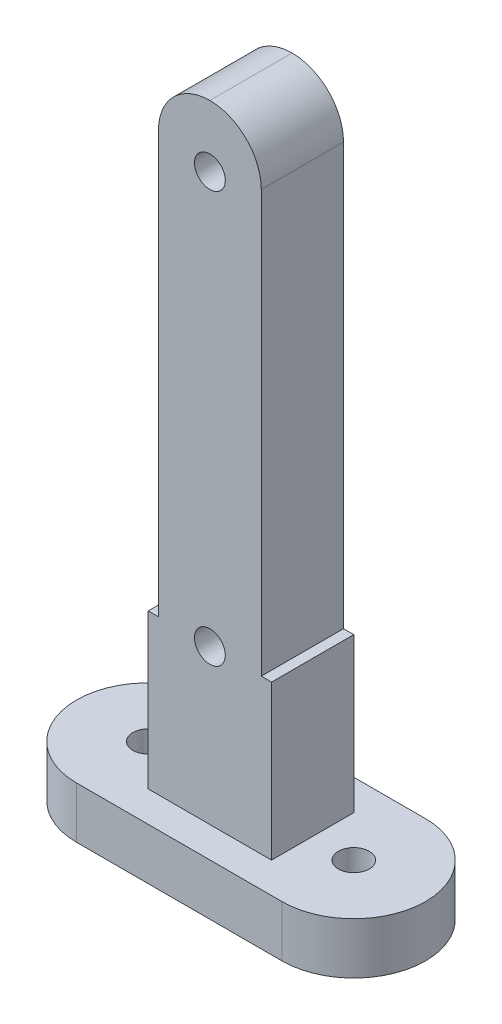
ISO-10303-21;
HEADER;
FILE_DESCRIPTION(('STEP AP214'),'2;1');
FILE_NAME('part.step','',(''),(''),'','','');
FILE_SCHEMA(('AUTOMOTIVE_DESIGN { 1 0 10303 214 1 1 1 1 }'));
ENDSEC;
DATA;
#1=APPLICATION_CONTEXT('core data for automotive mechanical design processes');
#2=APPLICATION_PROTOCOL_DEFINITION('international standard','automotive_design',2000,#1);
#3=PRODUCT_CONTEXT('',#1,'mechanical');
#4=PRODUCT('Part','Part','',(#3));
#5=PRODUCT_RELATED_PRODUCT_CATEGORY('part','',(#4));
#6=PRODUCT_DEFINITION_FORMATION('','',#4);
#7=PRODUCT_DEFINITION_CONTEXT('part definition',#1,'design');
#8=PRODUCT_DEFINITION('design','',#6,#7);
#9=PRODUCT_DEFINITION_SHAPE('','',#8);
#10=(LENGTH_UNIT() NAMED_UNIT(*) SI_UNIT(.MILLI.,.METRE.));
#11=(NAMED_UNIT(*) PLANE_ANGLE_UNIT() SI_UNIT($,.RADIAN.));
#12=(NAMED_UNIT(*) SI_UNIT($,.STERADIAN.) SOLID_ANGLE_UNIT());
#13=UNCERTAINTY_MEASURE_WITH_UNIT(LENGTH_MEASURE(1.E-05),#10,'distance_accuracy_value','');
#14=(GEOMETRIC_REPRESENTATION_CONTEXT(3) GLOBAL_UNCERTAINTY_ASSIGNED_CONTEXT((#13)) GLOBAL_UNIT_ASSIGNED_CONTEXT((#10,
#11,#12)) REPRESENTATION_CONTEXT('',''));
#15=CARTESIAN_POINT('',(0.,0.,0.));
#16=DIRECTION('',(0.,0.,1.));
#17=DIRECTION('',(1.,0.,0.));
#18=AXIS2_PLACEMENT_3D('',#15,#16,#17);
#19=CARTESIAN_POINT('',(0.,20.,0.));
#20=DIRECTION('',(0.,1.,0.));
#21=DIRECTION('',(0.,0.,1.));
#22=AXIS2_PLACEMENT_3D('',#19,#20,#21);
#23=PLANE('',#22);
#24=DIRECTION('',(1.,0.,0.));
#25=VECTOR('',#24,1.);
#26=CARTESIAN_POINT('',(-6.,20.,4.));
#27=LINE('',#26,#25);
#28=CARTESIAN_POINT('',(-6.,20.,4.));
#29=VERTEX_POINT('',#28);
#30=CARTESIAN_POINT('',(-5.,20.,4.));
#31=VERTEX_POINT('',#30);
#32=EDGE_CURVE('E216',#29,#31,#27,.T.);
#33=ORIENTED_EDGE('',*,*,#32,.T.);
#34=DIRECTION('',(0.,0.,-1.));
#35=VECTOR('',#34,1.);
#36=CARTESIAN_POINT('',(-5.,20.,0.));
#37=LINE('',#36,#35);
#38=CARTESIAN_POINT('',(-5.,20.,-4.));
#39=VERTEX_POINT('',#38);
#40=EDGE_CURVE('E197',#31,#39,#37,.T.);
#41=ORIENTED_EDGE('',*,*,#40,.T.);
#42=DIRECTION('',(1.,0.,0.));
#43=VECTOR('',#42,1.);
#44=CARTESIAN_POINT('',(-6.,20.,-4.));
#45=LINE('',#44,#43);
#46=CARTESIAN_POINT('',(-6.,20.,-4.));
#47=VERTEX_POINT('',#46);
#48=EDGE_CURVE('E339',#47,#39,#45,.T.);
#49=ORIENTED_EDGE('',*,*,#48,.F.);
#50=DIRECTION('',(0.,0.,-1.));
#51=VECTOR('',#50,1.);
#52=CARTESIAN_POINT('',(-6.,20.,4.));
#53=LINE('',#52,#51);
#54=EDGE_CURVE('E225',#29,#47,#53,.T.);
#55=ORIENTED_EDGE('',*,*,#54,.F.);
#56=EDGE_LOOP('',(#33,#41,#49,#55));
#57=FACE_BOUND('',#56,.T.);
#58=ADVANCED_FACE('F103',(#57),#23,.T.);
#59=CARTESIAN_POINT('',(-10.,5.,0.));
#60=DIRECTION('',(0.,1.,0.));
#61=DIRECTION('',(0.,0.,1.));
#62=AXIS2_PLACEMENT_3D('',#59,#60,#61);
#63=PLANE('',#62);
#64=DIRECTION('',(1.,0.,0.));
#65=VECTOR('',#64,1.);
#66=CARTESIAN_POINT('',(-6.,5.,-4.));
#67=LINE('',#66,#65);
#68=CARTESIAN_POINT('',(-6.,5.,-4.));
#69=VERTEX_POINT('',#68);
#70=CARTESIAN_POINT('',(6.,5.,-4.));
#71=VERTEX_POINT('',#70);
#72=EDGE_CURVE('E237',#69,#71,#67,.T.);
#73=ORIENTED_EDGE('',*,*,#72,.T.);
#74=DIRECTION('',(0.,0.,-1.));
#75=VECTOR('',#74,1.);
#76=CARTESIAN_POINT('',(6.,5.,4.));
#77=LINE('',#76,#75);
#78=CARTESIAN_POINT('',(6.,5.,4.));
#79=VERTEX_POINT('',#78);
#80=EDGE_CURVE('E241',#79,#71,#77,.T.);
#81=ORIENTED_EDGE('',*,*,#80,.F.);
#82=DIRECTION('',(1.,0.,0.));
#83=VECTOR('',#82,1.);
#84=CARTESIAN_POINT('',(-6.,5.,4.));
#85=LINE('',#84,#83);
#86=CARTESIAN_POINT('',(-6.,5.,4.));
#87=VERTEX_POINT('',#86);
#88=EDGE_CURVE('E245',#87,#79,#85,.T.);
#89=ORIENTED_EDGE('',*,*,#88,.F.);
#90=DIRECTION('',(0.,0.,-1.));
#91=VECTOR('',#90,1.);
#92=CARTESIAN_POINT('',(-6.,5.,4.));
#93=LINE('',#92,#91);
#94=EDGE_CURVE('E249',#87,#69,#93,.T.);
#95=ORIENTED_EDGE('',*,*,#94,.T.);
#96=EDGE_LOOP('',(#73,#81,#89,#95));
#97=FACE_BOUND('',#96,.T.);
#98=CARTESIAN_POINT('',(-10.,5.,0.));
#99=DIRECTION('',(0.,1.,0.));
#100=DIRECTION('',(0.,0.,1.));
#101=AXIS2_PLACEMENT_3D('',#98,#99,#100);
#102=CIRCLE('',#101,1.5);
#103=CARTESIAN_POINT('',(-10.,5.,1.5));
#104=VERTEX_POINT('',#103);
#105=EDGE_CURVE('E274',#104,#104,#102,.T.);
#106=ORIENTED_EDGE('',*,*,#105,.F.);
#107=EDGE_LOOP('',(#106));
#108=FACE_BOUND('',#107,.T.);
#109=CARTESIAN_POINT('',(-10.,5.,0.));
#110=DIRECTION('',(0.,1.,0.));
#111=DIRECTION('',(0.,0.,1.));
#112=AXIS2_PLACEMENT_3D('',#109,#110,#111);
#113=CIRCLE('',#112,6.98288273286698);
#114=CARTESIAN_POINT('',(-10.,5.,-6.98288273286698));
#115=VERTEX_POINT('',#114);
#116=CARTESIAN_POINT('',(-10.,5.,6.98288273286698));
#117=VERTEX_POINT('',#116);
#118=EDGE_CURVE('E282',#115,#117,#113,.T.);
#119=ORIENTED_EDGE('',*,*,#118,.T.);
#120=DIRECTION('',(1.,0.,0.));
#121=VECTOR('',#120,1.);
#122=CARTESIAN_POINT('',(-10.,5.,6.98288273286698));
#123=LINE('',#122,#121);
#124=CARTESIAN_POINT('',(10.,5.,6.98288273286698));
#125=VERTEX_POINT('',#124);
#126=EDGE_CURVE('E286',#117,#125,#123,.T.);
#127=ORIENTED_EDGE('',*,*,#126,.T.);
#128=CARTESIAN_POINT('',(10.,5.,0.));
#129=DIRECTION('',(0.,1.,0.));
#130=DIRECTION('',(0.,0.,1.));
#131=AXIS2_PLACEMENT_3D('',#128,#129,#130);
#132=CIRCLE('',#131,6.98288273286698);
#133=CARTESIAN_POINT('',(10.,5.,-6.98288273286698));
#134=VERTEX_POINT('',#133);
#135=EDGE_CURVE('E290',#125,#134,#132,.T.);
#136=ORIENTED_EDGE('',*,*,#135,.T.);
#137=DIRECTION('',(1.,0.,0.));
#138=VECTOR('',#137,1.);
#139=CARTESIAN_POINT('',(-10.,5.,-6.98288273286698));
#140=LINE('',#139,#138);
#141=EDGE_CURVE('E293',#115,#134,#140,.T.);
#142=ORIENTED_EDGE('',*,*,#141,.F.);
#143=EDGE_LOOP('',(#119,#127,#136,#142));
#144=FACE_BOUND('',#143,.T.);
#145=CARTESIAN_POINT('',(10.,5.,0.));
#146=DIRECTION('',(0.,1.,0.));
#147=DIRECTION('',(0.,0.,1.));
#148=AXIS2_PLACEMENT_3D('',#145,#146,#147);
#149=CIRCLE('',#148,1.5);
#150=CARTESIAN_POINT('',(10.,5.,1.5));
#151=VERTEX_POINT('',#150);
#152=EDGE_CURVE('E266',#151,#151,#149,.T.);
#153=ORIENTED_EDGE('',*,*,#152,.F.);
#154=EDGE_LOOP('',(#153));
#155=FACE_BOUND('',#154,.T.);
#156=ADVANCED_FACE('F367',(#97,#108,#144,#155),#63,.T.);
#157=CARTESIAN_POINT('',(-10.,0.,0.));
#158=DIRECTION('',(0.,1.,0.));
#159=DIRECTION('',(0.,0.,1.));
#160=AXIS2_PLACEMENT_3D('',#157,#158,#159);
#161=PLANE('',#160);
#162=CARTESIAN_POINT('',(-10.,0.,0.));
#163=DIRECTION('',(0.,1.,0.));
#164=DIRECTION('',(0.,0.,1.));
#165=AXIS2_PLACEMENT_3D('',#162,#163,#164);
#166=CIRCLE('',#165,6.98288273286698);
#167=CARTESIAN_POINT('',(-10.,0.,-6.98288273286698));
#168=VERTEX_POINT('',#167);
#169=CARTESIAN_POINT('',(-10.,0.,6.98288273286698));
#170=VERTEX_POINT('',#169);
#171=EDGE_CURVE('E278',#168,#170,#166,.T.);
#172=ORIENTED_EDGE('',*,*,#171,.F.);
#173=DIRECTION('',(1.,0.,0.));
#174=VECTOR('',#173,1.);
#175=CARTESIAN_POINT('',(-10.,0.,-6.98288273286698));
#176=LINE('',#175,#174);
#177=CARTESIAN_POINT('',(10.,0.,-6.98288273286698));
#178=VERTEX_POINT('',#177);
#179=EDGE_CURVE('E287',#168,#178,#176,.T.);
#180=ORIENTED_EDGE('',*,*,#179,.T.);
#181=CARTESIAN_POINT('',(10.,0.,0.));
#182=DIRECTION('',(0.,1.,0.));
#183=DIRECTION('',(0.,0.,1.));
#184=AXIS2_PLACEMENT_3D('',#181,#182,#183);
#185=CIRCLE('',#184,6.98288273286698);
#186=CARTESIAN_POINT('',(10.,0.,6.98288273286698));
#187=VERTEX_POINT('',#186);
#188=EDGE_CURVE('E304',#187,#178,#185,.T.);
#189=ORIENTED_EDGE('',*,*,#188,.F.);
#190=DIRECTION('',(1.,0.,0.));
#191=VECTOR('',#190,1.);
#192=CARTESIAN_POINT('',(-10.,0.,6.98288273286698));
#193=LINE('',#192,#191);
#194=EDGE_CURVE('E301',#170,#187,#193,.T.);
#195=ORIENTED_EDGE('',*,*,#194,.F.);
#196=EDGE_LOOP('',(#172,#180,#189,#195));
#197=FACE_BOUND('',#196,.T.);
#198=CARTESIAN_POINT('',(-10.,0.,0.));
#199=DIRECTION('',(0.,1.,0.));
#200=DIRECTION('',(0.,0.,1.));
#201=AXIS2_PLACEMENT_3D('',#198,#199,#200);
#202=CIRCLE('',#201,1.5);
#203=CARTESIAN_POINT('',(-10.,0.,1.5));
#204=VERTEX_POINT('',#203);
#205=EDGE_CURVE('E270',#204,#204,#202,.T.);
#206=ORIENTED_EDGE('',*,*,#205,.T.);
#207=EDGE_LOOP('',(#206));
#208=FACE_BOUND('',#207,.T.);
#209=CARTESIAN_POINT('',(10.,0.,0.));
#210=DIRECTION('',(0.,1.,0.));
#211=DIRECTION('',(0.,0.,1.));
#212=AXIS2_PLACEMENT_3D('',#209,#210,#211);
#213=CIRCLE('',#212,1.5);
#214=CARTESIAN_POINT('',(10.,0.,1.5));
#215=VERTEX_POINT('',#214);
#216=EDGE_CURVE('E257',#215,#215,#213,.T.);
#217=ORIENTED_EDGE('',*,*,#216,.T.);
#218=EDGE_LOOP('',(#217));
#219=FACE_BOUND('',#218,.T.);
#220=ADVANCED_FACE('F393',(#197,#208,#219),#161,.F.);
#221=CARTESIAN_POINT('',(-10.,5.,0.));
#222=DIRECTION('',(0.,-1.,0.));
#223=DIRECTION('',(0.,0.,-1.));
#224=AXIS2_PLACEMENT_3D('',#221,#222,#223);
#225=CYLINDRICAL_SURFACE('',#224,6.98288273286698);
#226=ORIENTED_EDGE('',*,*,#171,.T.);
#227=DIRECTION('',(0.,-1.,0.));
#228=VECTOR('',#227,1.);
#229=CARTESIAN_POINT('',(-10.,5.,6.98288273286698));
#230=LINE('',#229,#228);
#231=EDGE_CURVE('E210',#117,#170,#230,.T.);
#232=ORIENTED_EDGE('',*,*,#231,.F.);
#233=ORIENTED_EDGE('',*,*,#118,.F.);
#234=DIRECTION('',(0.,-1.,0.));
#235=VECTOR('',#234,1.);
#236=CARTESIAN_POINT('',(-10.,5.,-6.98288273286698));
#237=LINE('',#236,#235);
#238=EDGE_CURVE('E297',#115,#168,#237,.T.);
#239=ORIENTED_EDGE('',*,*,#238,.T.);
#240=EDGE_LOOP('',(#226,#232,#233,#239));
#241=FACE_BOUND('',#240,.T.);
#242=ADVANCED_FACE('F424',(#241),#225,.T.);
#243=CARTESIAN_POINT('',(-10.,5.,6.98288273286698));
#244=DIRECTION('',(0.,0.,-1.));
#245=DIRECTION('',(-1.,0.,0.));
#246=AXIS2_PLACEMENT_3D('',#243,#244,#245);
#247=PLANE('',#246);
#248=ORIENTED_EDGE('',*,*,#194,.T.);
#249=DIRECTION('',(0.,-1.,0.));
#250=VECTOR('',#249,1.);
#251=CARTESIAN_POINT('',(10.,5.,6.98288273286698));
#252=LINE('',#251,#250);
#253=EDGE_CURVE('E316',#125,#187,#252,.T.);
#254=ORIENTED_EDGE('',*,*,#253,.F.);
#255=ORIENTED_EDGE('',*,*,#126,.F.);
#256=ORIENTED_EDGE('',*,*,#231,.T.);
#257=EDGE_LOOP('',(#248,#254,#255,#256));
#258=FACE_BOUND('',#257,.T.);
#259=ADVANCED_FACE('F432',(#258),#247,.F.);
#260=CARTESIAN_POINT('',(10.,5.,0.));
#261=DIRECTION('',(0.,-1.,0.));
#262=DIRECTION('',(0.,0.,-1.));
#263=AXIS2_PLACEMENT_3D('',#260,#261,#262);
#264=CYLINDRICAL_SURFACE('',#263,6.98288273286698);
#265=ORIENTED_EDGE('',*,*,#188,.T.);
#266=DIRECTION('',(0.,-1.,0.));
#267=VECTOR('',#266,1.);
#268=CARTESIAN_POINT('',(10.,5.,-6.98288273286698));
#269=LINE('',#268,#267);
#270=EDGE_CURVE('E313',#134,#178,#269,.T.);
#271=ORIENTED_EDGE('',*,*,#270,.F.);
#272=ORIENTED_EDGE('',*,*,#135,.F.);
#273=ORIENTED_EDGE('',*,*,#253,.T.);
#274=EDGE_LOOP('',(#265,#271,#272,#273));
#275=FACE_BOUND('',#274,.T.);
#276=ADVANCED_FACE('F428',(#275),#264,.T.);
#277=CARTESIAN_POINT('',(-10.,5.,-6.98288273286698));
#278=DIRECTION('',(0.,0.,-1.));
#279=DIRECTION('',(-1.,0.,0.));
#280=AXIS2_PLACEMENT_3D('',#277,#278,#279);
#281=PLANE('',#280);
#282=ORIENTED_EDGE('',*,*,#179,.F.);
#283=ORIENTED_EDGE('',*,*,#238,.F.);
#284=ORIENTED_EDGE('',*,*,#141,.T.);
#285=ORIENTED_EDGE('',*,*,#270,.T.);
#286=EDGE_LOOP('',(#282,#283,#284,#285));
#287=FACE_BOUND('',#286,.T.);
#288=ADVANCED_FACE('F419',(#287),#281,.T.);
#289=CARTESIAN_POINT('',(-10.,5.,0.));
#290=DIRECTION('',(0.,-1.,0.));
#291=DIRECTION('',(0.,0.,-1.));
#292=AXIS2_PLACEMENT_3D('',#289,#290,#291);
#293=CYLINDRICAL_SURFACE('',#292,1.5);
#294=ORIENTED_EDGE('',*,*,#105,.T.);
#295=EDGE_LOOP('',(#294));
#296=FACE_BOUND('',#295,.T.);
#297=ORIENTED_EDGE('',*,*,#205,.F.);
#298=EDGE_LOOP('',(#297));
#299=FACE_BOUND('',#298,.T.);
#300=ADVANCED_FACE('F416',(#296,#299),#293,.F.);
#301=CARTESIAN_POINT('',(10.,5.,0.));
#302=DIRECTION('',(0.,-1.,0.));
#303=DIRECTION('',(0.,0.,-1.));
#304=AXIS2_PLACEMENT_3D('',#301,#302,#303);
#305=CYLINDRICAL_SURFACE('',#304,1.5);
#306=ORIENTED_EDGE('',*,*,#152,.T.);
#307=EDGE_LOOP('',(#306));
#308=FACE_BOUND('',#307,.T.);
#309=ORIENTED_EDGE('',*,*,#216,.F.);
#310=EDGE_LOOP('',(#309));
#311=FACE_BOUND('',#310,.T.);
#312=ADVANCED_FACE('F412',(#308,#311),#305,.F.);
#313=CARTESIAN_POINT('',(-6.,20.,-4.));
#314=DIRECTION('',(0.,0.,-1.));
#315=DIRECTION('',(-1.,0.,0.));
#316=AXIS2_PLACEMENT_3D('',#313,#314,#315);
#317=PLANE('',#316);
#318=CARTESIAN_POINT('',(0.,20.,-4.));
#319=DIRECTION('',(0.,0.,1.));
#320=DIRECTION('',(1.,0.,0.));
#321=AXIS2_PLACEMENT_3D('',#318,#319,#320);
#322=CIRCLE('',#321,1.5);
#323=CARTESIAN_POINT('',(1.5,20.,-4.));
#324=VERTEX_POINT('',#323);
#325=EDGE_CURVE('E348',#324,#324,#322,.T.);
#326=ORIENTED_EDGE('',*,*,#325,.T.);
#327=EDGE_LOOP('',(#326));
#328=FACE_BOUND('',#327,.T.);
#329=DIRECTION('',(0.,1.,0.));
#330=VECTOR('',#329,1.);
#331=CARTESIAN_POINT('',(-5.,15.6245028579639,-4.));
#332=LINE('',#331,#330);
#333=CARTESIAN_POINT('',(-5.,61.,-4.));
#334=VERTEX_POINT('',#333);
#335=EDGE_CURVE('E203',#39,#334,#332,.T.);
#336=ORIENTED_EDGE('',*,*,#335,.T.);
#337=CARTESIAN_POINT('',(0.,61.,-4.));
#338=DIRECTION('',(0.,0.,-1.));
#339=DIRECTION('',(-1.,0.,0.));
#340=AXIS2_PLACEMENT_3D('',#337,#338,#339);
#341=CIRCLE('',#340,5.);
#342=CARTESIAN_POINT('',(0.,66.,-4.));
#343=VERTEX_POINT('',#342);
#344=EDGE_CURVE('E113',#334,#343,#341,.T.);
#345=ORIENTED_EDGE('',*,*,#344,.T.);
#346=CARTESIAN_POINT('',(0.,61.,-4.));
#347=DIRECTION('',(0.,0.,-1.));
#348=DIRECTION('',(-1.,0.,0.));
#349=AXIS2_PLACEMENT_3D('',#346,#347,#348);
#350=CIRCLE('',#349,5.);
#351=CARTESIAN_POINT('',(5.,61.,-4.));
#352=VERTEX_POINT('',#351);
#353=EDGE_CURVE('E123',#343,#352,#350,.T.);
#354=ORIENTED_EDGE('',*,*,#353,.T.);
#355=DIRECTION('',(0.,1.,0.));
#356=VECTOR('',#355,1.);
#357=CARTESIAN_POINT('',(5.,15.6245028579639,-4.));
#358=LINE('',#357,#356);
#359=CARTESIAN_POINT('',(5.,20.,-4.));
#360=VERTEX_POINT('',#359);
#361=EDGE_CURVE('E221',#360,#352,#358,.T.);
#362=ORIENTED_EDGE('',*,*,#361,.F.);
#363=CARTESIAN_POINT('',(6.,20.,-4.));
#364=VERTEX_POINT('',#363);
#365=EDGE_CURVE('E253',#360,#364,#45,.T.);
#366=ORIENTED_EDGE('',*,*,#365,.T.);
#367=DIRECTION('',(0.,-1.,0.));
#368=VECTOR('',#367,1.);
#369=CARTESIAN_POINT('',(6.,20.,-4.));
#370=LINE('',#369,#368);
#371=EDGE_CURVE('E231',#364,#71,#370,.T.);
#372=ORIENTED_EDGE('',*,*,#371,.T.);
#373=ORIENTED_EDGE('',*,*,#72,.F.);
#374=DIRECTION('',(0.,-1.,0.));
#375=VECTOR('',#374,1.);
#376=CARTESIAN_POINT('',(-6.,20.,-4.));
#377=LINE('',#376,#375);
#378=EDGE_CURVE('E254',#47,#69,#377,.T.);
#379=ORIENTED_EDGE('',*,*,#378,.F.);
#380=ORIENTED_EDGE('',*,*,#48,.T.);
#381=EDGE_LOOP('',(#336,#345,#354,#362,#366,#372,#373,#379,#380));
#382=FACE_BOUND('',#381,.T.);
#383=CARTESIAN_POINT('',(0.,60.,-4.));
#384=DIRECTION('',(0.,0.,1.));
#385=DIRECTION('',(1.,0.,0.));
#386=AXIS2_PLACEMENT_3D('',#383,#384,#385);
#387=CIRCLE('',#386,1.5);
#388=CARTESIAN_POINT('',(1.5,60.,-4.));
#389=VERTEX_POINT('',#388);
#390=EDGE_CURVE('E634',#389,#389,#387,.T.);
#391=ORIENTED_EDGE('',*,*,#390,.T.);
#392=EDGE_LOOP('',(#391));
#393=FACE_BOUND('',#392,.T.);
#394=ADVANCED_FACE('F337',(#328,#382,#393),#317,.T.);
#395=CARTESIAN_POINT('',(-6.,20.,4.));
#396=DIRECTION('',(-1.,0.,0.));
#397=DIRECTION('',(0.,0.,1.));
#398=AXIS2_PLACEMENT_3D('',#395,#396,#397);
#399=PLANE('',#398);
#400=ORIENTED_EDGE('',*,*,#94,.F.);
#401=DIRECTION('',(0.,-1.,0.));
#402=VECTOR('',#401,1.);
#403=CARTESIAN_POINT('',(-6.,20.,4.));
#404=LINE('',#403,#402);
#405=EDGE_CURVE('E258',#29,#87,#404,.T.);
#406=ORIENTED_EDGE('',*,*,#405,.F.);
#407=ORIENTED_EDGE('',*,*,#54,.T.);
#408=ORIENTED_EDGE('',*,*,#378,.T.);
#409=EDGE_LOOP('',(#400,#406,#407,#408));
#410=FACE_BOUND('',#409,.T.);
#411=ADVANCED_FACE('F371',(#410),#399,.T.);
#412=CARTESIAN_POINT('',(-6.,20.,4.));
#413=DIRECTION('',(0.,0.,-1.));
#414=DIRECTION('',(-1.,0.,0.));
#415=AXIS2_PLACEMENT_3D('',#412,#413,#414);
#416=PLANE('',#415);
#417=CARTESIAN_POINT('',(0.,61.,4.));
#418=DIRECTION('',(0.,0.,-1.));
#419=DIRECTION('',(-1.,0.,0.));
#420=AXIS2_PLACEMENT_3D('',#417,#418,#419);
#421=CIRCLE('',#420,5.);
#422=CARTESIAN_POINT('',(5.,61.,4.));
#423=VERTEX_POINT('',#422);
#424=CARTESIAN_POINT('',(0.,66.,4.));
#425=VERTEX_POINT('',#424);
#426=EDGE_CURVE('E325',#423,#425,#421,.F.);
#427=ORIENTED_EDGE('',*,*,#426,.T.);
#428=CARTESIAN_POINT('',(0.,61.,4.));
#429=DIRECTION('',(0.,0.,-1.));
#430=DIRECTION('',(-1.,0.,0.));
#431=AXIS2_PLACEMENT_3D('',#428,#429,#430);
#432=CIRCLE('',#431,5.);
#433=CARTESIAN_POINT('',(-5.,61.,4.));
#434=VERTEX_POINT('',#433);
#435=EDGE_CURVE('E219',#425,#434,#432,.F.);
#436=ORIENTED_EDGE('',*,*,#435,.T.);
#437=DIRECTION('',(0.,1.,0.));
#438=VECTOR('',#437,1.);
#439=CARTESIAN_POINT('',(-5.,15.6245028579639,4.));
#440=LINE('',#439,#438);
#441=EDGE_CURVE('E201',#31,#434,#440,.T.);
#442=ORIENTED_EDGE('',*,*,#441,.F.);
#443=ORIENTED_EDGE('',*,*,#32,.F.);
#444=ORIENTED_EDGE('',*,*,#405,.T.);
#445=ORIENTED_EDGE('',*,*,#88,.T.);
#446=DIRECTION('',(0.,-1.,0.));
#447=VECTOR('',#446,1.);
#448=CARTESIAN_POINT('',(6.,20.,4.));
#449=LINE('',#448,#447);
#450=CARTESIAN_POINT('',(6.,20.,4.));
#451=VERTEX_POINT('',#450);
#452=EDGE_CURVE('E261',#451,#79,#449,.T.);
#453=ORIENTED_EDGE('',*,*,#452,.F.);
#454=CARTESIAN_POINT('',(5.,20.,4.));
#455=VERTEX_POINT('',#454);
#456=EDGE_CURVE('E227',#455,#451,#27,.T.);
#457=ORIENTED_EDGE('',*,*,#456,.F.);
#458=DIRECTION('',(0.,1.,0.));
#459=VECTOR('',#458,1.);
#460=CARTESIAN_POINT('',(5.,15.6245028579639,4.));
#461=LINE('',#460,#459);
#462=EDGE_CURVE('E222',#455,#423,#461,.T.);
#463=ORIENTED_EDGE('',*,*,#462,.T.);
#464=EDGE_LOOP('',(#427,#436,#442,#443,#444,#445,#453,#457,#463));
#465=FACE_BOUND('',#464,.T.);
#466=CARTESIAN_POINT('',(0.,20.,4.));
#467=DIRECTION('',(0.,0.,1.));
#468=DIRECTION('',(1.,0.,0.));
#469=AXIS2_PLACEMENT_3D('',#466,#467,#468);
#470=CIRCLE('',#469,1.5);
#471=CARTESIAN_POINT('',(1.5,20.,4.));
#472=VERTEX_POINT('',#471);
#473=EDGE_CURVE('E641',#472,#472,#470,.T.);
#474=ORIENTED_EDGE('',*,*,#473,.F.);
#475=EDGE_LOOP('',(#474));
#476=FACE_BOUND('',#475,.T.);
#477=CARTESIAN_POINT('',(0.,60.,4.));
#478=DIRECTION('',(0.,0.,1.));
#479=DIRECTION('',(1.,0.,0.));
#480=AXIS2_PLACEMENT_3D('',#477,#478,#479);
#481=CIRCLE('',#480,1.5);
#482=CARTESIAN_POINT('',(1.5,60.,4.));
#483=VERTEX_POINT('',#482);
#484=EDGE_CURVE('E379',#483,#483,#481,.T.);
#485=ORIENTED_EDGE('',*,*,#484,.F.);
#486=EDGE_LOOP('',(#485));
#487=FACE_BOUND('',#486,.T.);
#488=ADVANCED_FACE('F214',(#465,#476,#487),#416,.F.);
#489=CARTESIAN_POINT('',(6.,20.,4.));
#490=DIRECTION('',(-1.,0.,0.));
#491=DIRECTION('',(0.,0.,1.));
#492=AXIS2_PLACEMENT_3D('',#489,#490,#491);
#493=PLANE('',#492);
#494=ORIENTED_EDGE('',*,*,#80,.T.);
#495=ORIENTED_EDGE('',*,*,#371,.F.);
#496=DIRECTION('',(0.,0.,-1.));
#497=VECTOR('',#496,1.);
#498=CARTESIAN_POINT('',(6.,20.,4.));
#499=LINE('',#498,#497);
#500=EDGE_CURVE('E233',#451,#364,#499,.T.);
#501=ORIENTED_EDGE('',*,*,#500,.F.);
#502=ORIENTED_EDGE('',*,*,#452,.T.);
#503=EDGE_LOOP('',(#494,#495,#501,#502));
#504=FACE_BOUND('',#503,.T.);
#505=ADVANCED_FACE('F363',(#504),#493,.F.);
#506=DIRECTION('',(0.,0.,-1.));
#507=VECTOR('',#506,1.);
#508=CARTESIAN_POINT('',(5.,20.,0.));
#509=LINE('',#508,#507);
#510=EDGE_CURVE('E209',#455,#360,#509,.T.);
#511=ORIENTED_EDGE('',*,*,#510,.F.);
#512=ORIENTED_EDGE('',*,*,#456,.T.);
#513=ORIENTED_EDGE('',*,*,#500,.T.);
#514=ORIENTED_EDGE('',*,*,#365,.F.);
#515=EDGE_LOOP('',(#511,#512,#513,#514));
#516=FACE_BOUND('',#515,.T.);
#517=ADVANCED_FACE('F359',(#516),#23,.T.);
#518=CARTESIAN_POINT('',(5.,15.6245028579639,-4.));
#519=DIRECTION('',(1.,0.,0.));
#520=DIRECTION('',(0.,0.,-1.));
#521=AXIS2_PLACEMENT_3D('',#518,#519,#520);
#522=PLANE('',#521);
#523=ORIENTED_EDGE('',*,*,#361,.T.);
#524=DIRECTION('',(0.,0.,1.));
#525=VECTOR('',#524,1.);
#526=CARTESIAN_POINT('',(5.,61.,4.));
#527=LINE('',#526,#525);
#528=EDGE_CURVE('E12',#352,#423,#527,.T.);
#529=ORIENTED_EDGE('',*,*,#528,.T.);
#530=ORIENTED_EDGE('',*,*,#462,.F.);
#531=ORIENTED_EDGE('',*,*,#510,.T.);
#532=EDGE_LOOP('',(#523,#529,#530,#531));
#533=FACE_BOUND('',#532,.T.);
#534=ADVANCED_FACE('F398',(#533),#522,.T.);
#535=CARTESIAN_POINT('',(-5.,15.6245028579639,-4.));
#536=DIRECTION('',(1.,0.,0.));
#537=DIRECTION('',(0.,0.,-1.));
#538=AXIS2_PLACEMENT_3D('',#535,#536,#537);
#539=PLANE('',#538);
#540=ORIENTED_EDGE('',*,*,#441,.T.);
#541=DIRECTION('',(0.,0.,1.));
#542=VECTOR('',#541,1.);
#543=CARTESIAN_POINT('',(-5.,61.,-4.));
#544=LINE('',#543,#542);
#545=EDGE_CURVE('E330',#434,#334,#544,.F.);
#546=ORIENTED_EDGE('',*,*,#545,.T.);
#547=ORIENTED_EDGE('',*,*,#335,.F.);
#548=ORIENTED_EDGE('',*,*,#40,.F.);
#549=EDGE_LOOP('',(#540,#546,#547,#548));
#550=FACE_BOUND('',#549,.T.);
#551=ADVANCED_FACE('F199',(#550),#539,.F.);
#552=CARTESIAN_POINT('',(0.,20.,-4.));
#553=DIRECTION('',(0.,0.,1.));
#554=DIRECTION('',(1.,0.,0.));
#555=AXIS2_PLACEMENT_3D('',#552,#553,#554);
#556=CYLINDRICAL_SURFACE('',#555,1.5);
#557=ORIENTED_EDGE('',*,*,#473,.T.);
#558=EDGE_LOOP('',(#557));
#559=FACE_BOUND('',#558,.T.);
#560=ORIENTED_EDGE('',*,*,#325,.F.);
#561=EDGE_LOOP('',(#560));
#562=FACE_BOUND('',#561,.T.);
#563=ADVANCED_FACE('F504',(#559,#562),#556,.F.);
#564=CARTESIAN_POINT('',(0.,60.,-4.));
#565=DIRECTION('',(0.,0.,1.));
#566=DIRECTION('',(1.,0.,0.));
#567=AXIS2_PLACEMENT_3D('',#564,#565,#566);
#568=CYLINDRICAL_SURFACE('',#567,1.5);
#569=ORIENTED_EDGE('',*,*,#390,.F.);
#570=EDGE_LOOP('',(#569));
#571=FACE_BOUND('',#570,.T.);
#572=ORIENTED_EDGE('',*,*,#484,.T.);
#573=EDGE_LOOP('',(#572));
#574=FACE_BOUND('',#573,.T.);
#575=ADVANCED_FACE('F386',(#571,#574),#568,.F.);
#576=CARTESIAN_POINT('',(0.,61.,-4.));
#577=DIRECTION('',(0.,0.,-1.));
#578=DIRECTION('',(-1.,0.,0.));
#579=AXIS2_PLACEMENT_3D('',#576,#577,#578);
#580=CYLINDRICAL_SURFACE('',#579,5.);
#581=ORIENTED_EDGE('',*,*,#528,.F.);
#582=ORIENTED_EDGE('',*,*,#353,.F.);
#583=DIRECTION('',(0.,0.,1.));
#584=VECTOR('',#583,1.);
#585=CARTESIAN_POINT('',(0.,66.,-4.));
#586=LINE('',#585,#584);
#587=EDGE_CURVE('E107',#425,#343,#586,.F.);
#588=ORIENTED_EDGE('',*,*,#587,.F.);
#589=ORIENTED_EDGE('',*,*,#426,.F.);
#590=EDGE_LOOP('',(#581,#582,#588,#589));
#591=FACE_BOUND('',#590,.T.);
#592=ADVANCED_FACE('F105',(#591),#580,.T.);
#593=CARTESIAN_POINT('',(0.,61.,-4.));
#594=DIRECTION('',(0.,0.,1.));
#595=DIRECTION('',(1.,0.,0.));
#596=AXIS2_PLACEMENT_3D('',#593,#594,#595);
#597=CYLINDRICAL_SURFACE('',#596,5.);
#598=ORIENTED_EDGE('',*,*,#344,.F.);
#599=ORIENTED_EDGE('',*,*,#545,.F.);
#600=ORIENTED_EDGE('',*,*,#435,.F.);
#601=ORIENTED_EDGE('',*,*,#587,.T.);
#602=EDGE_LOOP('',(#598,#599,#600,#601));
#603=FACE_BOUND('',#602,.T.);
#604=ADVANCED_FACE('F380',(#603),#597,.T.);
#605=CLOSED_SHELL('',(#58,#156,#220,#242,#259,#276,#288,#300,#312,#394,#411,#488,#505,#517,#534,
#551,#563,#575,#592,#604));
#606=MANIFOLD_SOLID_BREP('B2',#605);
#607=ADVANCED_BREP_SHAPE_REPRESENTATION('',(#18,#606),#14);
#608=SHAPE_DEFINITION_REPRESENTATION(#9,#607);
ENDSEC;
END-ISO-10303-21;
